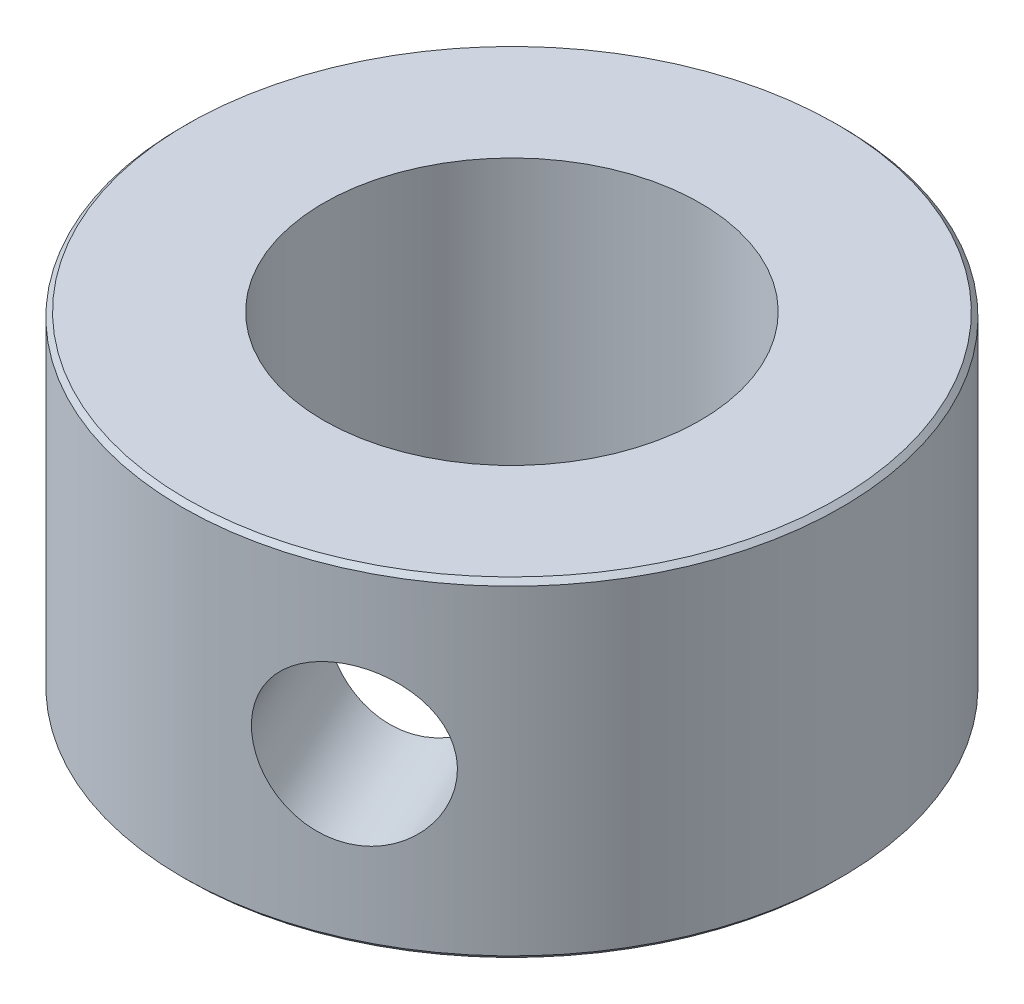
ISO-10303-21;
HEADER;
FILE_DESCRIPTION(('STEP AP214'),'2;1');
FILE_NAME('part.step','',(''),(''),'','','');
FILE_SCHEMA(('AUTOMOTIVE_DESIGN { 1 0 10303 214 1 1 1 1 }'));
ENDSEC;
DATA;
#1=APPLICATION_CONTEXT('core data for automotive mechanical design processes');
#2=APPLICATION_PROTOCOL_DEFINITION('international standard','automotive_design',2000,#1);
#3=PRODUCT_CONTEXT('',#1,'mechanical');
#4=PRODUCT('Part','Part','',(#3));
#5=PRODUCT_RELATED_PRODUCT_CATEGORY('part','',(#4));
#6=PRODUCT_DEFINITION_FORMATION('','',#4);
#7=PRODUCT_DEFINITION_CONTEXT('part definition',#1,'design');
#8=PRODUCT_DEFINITION('design','',#6,#7);
#9=PRODUCT_DEFINITION_SHAPE('','',#8);
#10=(LENGTH_UNIT() NAMED_UNIT(*) SI_UNIT(.MILLI.,.METRE.));
#11=(NAMED_UNIT(*) PLANE_ANGLE_UNIT() SI_UNIT($,.RADIAN.));
#12=(NAMED_UNIT(*) SI_UNIT($,.STERADIAN.) SOLID_ANGLE_UNIT());
#13=UNCERTAINTY_MEASURE_WITH_UNIT(LENGTH_MEASURE(1.E-05),#10,'distance_accuracy_value','');
#14=(GEOMETRIC_REPRESENTATION_CONTEXT(3) GLOBAL_UNCERTAINTY_ASSIGNED_CONTEXT((#13)) GLOBAL_UNIT_ASSIGNED_CONTEXT((#10,
#11,#12)) REPRESENTATION_CONTEXT('',''));
#15=CARTESIAN_POINT('',(0.,0.,0.));
#16=DIRECTION('',(0.,0.,1.));
#17=DIRECTION('',(1.,0.,0.));
#18=AXIS2_PLACEMENT_3D('',#15,#16,#17);
#19=CARTESIAN_POINT('',(0.,7.,0.));
#20=DIRECTION('',(0.,1.,0.));
#21=DIRECTION('',(0.,0.,1.));
#22=AXIS2_PLACEMENT_3D('',#19,#20,#21);
#23=PLANE('',#22);
#24=CARTESIAN_POINT('',(0.,7.,0.));
#25=DIRECTION('',(0.,1.,0.));
#26=DIRECTION('',(0.,0.,1.));
#27=AXIS2_PLACEMENT_3D('',#24,#25,#26);
#28=CIRCLE('',#27,6.9);
#29=CARTESIAN_POINT('',(0.,7.,6.9));
#30=VERTEX_POINT('',#29);
#31=EDGE_CURVE('E10',#30,#30,#28,.T.);
#32=ORIENTED_EDGE('',*,*,#31,.T.);
#33=EDGE_LOOP('',(#32));
#34=FACE_BOUND('',#33,.T.);
#35=CARTESIAN_POINT('',(0.,7.,0.));
#36=DIRECTION('',(0.,1.,0.));
#37=DIRECTION('',(0.,0.,1.));
#38=AXIS2_PLACEMENT_3D('',#35,#36,#37);
#39=CIRCLE('',#38,4.);
#40=CARTESIAN_POINT('',(0.,7.,4.));
#41=VERTEX_POINT('',#40);
#42=EDGE_CURVE('E66',#41,#41,#39,.T.);
#43=ORIENTED_EDGE('',*,*,#42,.F.);
#44=EDGE_LOOP('',(#43));
#45=FACE_BOUND('',#44,.T.);
#46=ADVANCED_FACE('F38',(#34,#45),#23,.T.);
#47=CARTESIAN_POINT('',(0.,0.,0.));
#48=DIRECTION('',(0.,1.,0.));
#49=DIRECTION('',(0.,0.,1.));
#50=AXIS2_PLACEMENT_3D('',#47,#48,#49);
#51=PLANE('',#50);
#52=CARTESIAN_POINT('',(0.,0.,0.));
#53=DIRECTION('',(0.,1.,0.));
#54=DIRECTION('',(0.,0.,1.));
#55=AXIS2_PLACEMENT_3D('',#52,#53,#54);
#56=CIRCLE('',#55,6.9);
#57=CARTESIAN_POINT('',(0.,0.,6.9));
#58=VERTEX_POINT('',#57);
#59=EDGE_CURVE('E45',#58,#58,#56,.F.);
#60=ORIENTED_EDGE('',*,*,#59,.T.);
#61=EDGE_LOOP('',(#60));
#62=FACE_BOUND('',#61,.T.);
#63=CARTESIAN_POINT('',(0.,0.,0.));
#64=DIRECTION('',(0.,1.,0.));
#65=DIRECTION('',(0.,0.,1.));
#66=AXIS2_PLACEMENT_3D('',#63,#64,#65);
#67=CIRCLE('',#66,4.);
#68=CARTESIAN_POINT('',(0.,0.,4.));
#69=VERTEX_POINT('',#68);
#70=EDGE_CURVE('E67',#69,#69,#67,.T.);
#71=ORIENTED_EDGE('',*,*,#70,.T.);
#72=EDGE_LOOP('',(#71));
#73=FACE_BOUND('',#72,.T.);
#74=ADVANCED_FACE('F94',(#62,#73),#51,.F.);
#75=CARTESIAN_POINT('',(0.,7.,0.));
#76=DIRECTION('',(0.,-1.,0.));
#77=DIRECTION('',(0.,0.,-1.));
#78=AXIS2_PLACEMENT_3D('',#75,#76,#77);
#79=CYLINDRICAL_SURFACE('',#78,7.);
#80=CARTESIAN_POINT('',(0.,0.1,0.));
#81=DIRECTION('',(0.,1.,0.));
#82=DIRECTION('',(0.,0.,1.));
#83=AXIS2_PLACEMENT_3D('',#80,#81,#82);
#84=CIRCLE('',#83,7.);
#85=CARTESIAN_POINT('',(0.,0.1,7.));
#86=VERTEX_POINT('',#85);
#87=EDGE_CURVE('E49',#86,#86,#84,.T.);
#88=ORIENTED_EDGE('',*,*,#87,.T.);
#89=EDGE_LOOP('',(#88));
#90=FACE_BOUND('',#89,.T.);
#91=CARTESIAN_POINT('',(0.,6.9,0.));
#92=DIRECTION('',(0.,1.,0.));
#93=DIRECTION('',(0.,0.,1.));
#94=AXIS2_PLACEMENT_3D('',#91,#92,#93);
#95=CIRCLE('',#94,7.);
#96=CARTESIAN_POINT('',(0.,6.9,7.));
#97=VERTEX_POINT('',#96);
#98=EDGE_CURVE('E53',#97,#97,#95,.F.);
#99=ORIENTED_EDGE('',*,*,#98,.T.);
#100=EDGE_LOOP('',(#99));
#101=FACE_BOUND('',#100,.T.);
#102=CARTESIAN_POINT('',(4.33695475854196,3.5,5.49461767754229));
#103=CARTESIAN_POINT('',(4.33695290809923,3.40871099997652,5.49462052617283));
#104=CARTESIAN_POINT('',(4.3308204478108,3.31738900161891,5.49947661884195));
#105=CARTESIAN_POINT('',(4.30642007110906,3.13735543656597,5.51860289653467));
#106=CARTESIAN_POINT('',(4.28814428934161,3.04864560071145,5.53287918307316));
#107=CARTESIAN_POINT('',(4.23988238827224,2.87646648747663,5.56994752920899));
#108=CARTESIAN_POINT('',(4.20991030824941,2.79299106604051,5.5927293780118));
#109=CARTESIAN_POINT('',(4.13886227276357,2.63338346720996,5.6455087575473));
#110=CARTESIAN_POINT('',(4.09778617216883,2.55725138581207,5.67550638259104));
#111=CARTESIAN_POINT('',(4.00448567264662,2.41300017131406,5.74172584098752));
#112=CARTESIAN_POINT('',(3.95207750988321,2.34504595472282,5.77804807616412));
#113=CARTESIAN_POINT('',(3.83756477380056,2.22052828829884,5.85472773588049));
#114=CARTESIAN_POINT('',(3.77545936948574,2.16396581562249,5.8950855061348));
#115=CARTESIAN_POINT('',(3.64198656861028,2.06317303018274,5.97847741494681));
#116=CARTESIAN_POINT('',(3.57051454492172,2.01910313876716,6.02153838899059));
#117=CARTESIAN_POINT('',(3.42057086009637,1.94558709172224,6.10795974013822));
#118=CARTESIAN_POINT('',(3.34210011561603,1.91613902430984,6.1513200773487));
#119=CARTESIAN_POINT('',(3.18166938286995,1.87322629782889,6.2357875098592));
#120=CARTESIAN_POINT('',(3.09979824945055,1.85948200603305,6.27692118266486));
#121=CARTESIAN_POINT('',(2.93356847400079,1.84749086323874,6.35630825329692));
#122=CARTESIAN_POINT('',(2.84921016192308,1.84924196573697,6.39456203080304));
#123=CARTESIAN_POINT('',(2.68219217534081,1.86798740501017,6.46637071990166));
#124=CARTESIAN_POINT('',(2.59953184601341,1.88468011500454,6.50000348980106));
#125=CARTESIAN_POINT('',(2.4366723032739,1.93235207443574,6.56279283289124));
#126=CARTESIAN_POINT('',(2.35647321238835,1.96333203390087,6.59194918352302));
#127=CARTESIAN_POINT('',(2.20026957556281,2.03895377039328,6.6457279442721));
#128=CARTESIAN_POINT('',(2.12430510224419,2.08370617046967,6.67031095667816));
#129=CARTESIAN_POINT('',(1.97956239020466,2.185519225885,6.71469078440217));
#130=CARTESIAN_POINT('',(1.91078527806698,2.24258180650105,6.73448685002701));
#131=CARTESIAN_POINT('',(1.7809711301695,2.36902452509401,6.76999157550689));
#132=CARTESIAN_POINT('',(1.72016071769164,2.43866849569449,6.78559016682727));
#133=CARTESIAN_POINT('',(1.61032671076822,2.5874443211498,6.81249254702226));
#134=CARTESIAN_POINT('',(1.56130354929443,2.66657652436841,6.82379617814235));
#135=CARTESIAN_POINT('',(1.47666330208507,2.83253525980706,6.84261364703833));
#136=CARTESIAN_POINT('',(1.44109924109201,2.91939059395085,6.85011253398433));
#137=CARTESIAN_POINT('',(1.38508822355287,3.09806127756916,6.86165848349057));
#138=CARTESIAN_POINT('',(1.36463843423409,3.18987569413077,6.86570619290513));
#139=CARTESIAN_POINT('',(1.34002741741275,3.37353855694924,6.87055176369806));
#140=CARTESIAN_POINT('',(1.33549350857823,3.46533515973006,6.87142399940529));
#141=CARTESIAN_POINT('',(1.34186731452449,3.64836457658374,6.87018213154625));
#142=CARTESIAN_POINT('',(1.35277378107572,3.73959743563189,6.86806826938189));
#143=CARTESIAN_POINT('',(1.38929825352498,3.91757745074746,6.86077149304204));
#144=CARTESIAN_POINT('',(1.41470564674566,4.00436984565374,6.85563248349688));
#145=CARTESIAN_POINT('',(1.47907488594476,4.17249368663451,6.8420328006842));
#146=CARTESIAN_POINT('',(1.51803819629995,4.25382454159378,6.83357176854278));
#147=CARTESIAN_POINT('',(1.6089117198084,4.41029905658938,6.81275318003319));
#148=CARTESIAN_POINT('',(1.66103829699158,4.48530818474253,6.80032948918988));
#149=CARTESIAN_POINT('',(1.7760975232139,4.62557800629822,6.7711883829357));
#150=CARTESIAN_POINT('',(1.8390317422003,4.69083728083161,6.75447034354099));
#151=CARTESIAN_POINT('',(1.97518588680678,4.81122298204254,6.71593224186882));
#152=CARTESIAN_POINT('',(2.04860137475439,4.86609535547159,6.69400817940542));
#153=CARTESIAN_POINT('',(2.20227224150703,4.9623180167779,6.64503502097462));
#154=CARTESIAN_POINT('',(2.2825272771498,5.00366898256504,6.61798618205064));
#155=CARTESIAN_POINT('',(2.4467542621969,5.0713378389333,6.55903535520843));
#156=CARTESIAN_POINT('',(2.53069634784018,5.0977586745676,6.52716857053034));
#157=CARTESIAN_POINT('',(2.70016326638837,5.13513286894145,6.45890503545275));
#158=CARTESIAN_POINT('',(2.7856878272703,5.14608886147333,6.42250905756199));
#159=CARTESIAN_POINT('',(2.95361249294322,5.15208813057132,6.34700294170077));
#160=CARTESIAN_POINT('',(3.03603823759707,5.14750832426095,6.30797929141249));
#161=CARTESIAN_POINT('',(3.19753347433021,5.12341975270526,6.22767321304482));
#162=CARTESIAN_POINT('',(3.27660304663566,5.10391134452658,6.18639083901215));
#163=CARTESIAN_POINT('',(3.42899022222941,5.05071176108927,6.10323970829406));
#164=CARTESIAN_POINT('',(3.50233107509893,5.01708187051131,6.06137423230331));
#165=CARTESIAN_POINT('',(3.64194798969843,4.9366509910792,5.97852928259634));
#166=CARTESIAN_POINT('',(3.7082232512061,4.88984851252764,5.93754990965491));
#167=CARTESIAN_POINT('',(3.83368684312346,4.78321390355334,5.85734707854002));
#168=CARTESIAN_POINT('',(3.89269059682572,4.72312153020512,5.81818087222184));
#169=CARTESIAN_POINT('',(4.000747446629,4.59212760248887,5.74441554290829));
#170=CARTESIAN_POINT('',(4.04979808207846,4.52122338274089,5.70981755002243));
#171=CARTESIAN_POINT('',(4.13770229302743,4.36924540614473,5.64645114230857));
#172=CARTESIAN_POINT('',(4.17637911535602,4.2880263885213,5.61778547287829));
#173=CARTESIAN_POINT('',(4.2416620994615,4.11860266624687,5.56866088592655));
#174=CARTESIAN_POINT('',(4.26827773329602,4.03040350750556,5.54819552989044));
#175=CARTESIAN_POINT('',(4.30463016708739,3.86853084559052,5.52001492462501));
#176=CARTESIAN_POINT('',(4.31673458241366,3.79568399515568,5.5105270007543));
#177=CARTESIAN_POINT('',(4.3328973646978,3.64856531846772,5.49782742587969));
#178=CARTESIAN_POINT('',(4.33695626448493,3.57429358690895,5.49461535924566));
#179=CARTESIAN_POINT('',(4.33695475854196,3.5,5.49461767754229));
#180=B_SPLINE_CURVE_WITH_KNOTS('',3,(#102,#103,#104,#105,#106,#107,#108,#109,#110,#111,#112,
#113,#114,#115,#116,#117,#118,#119,#120,#121,#122,#123,#124,#125,#126,#127,#128,#129,#130,#131,
#132,#133,#134,#135,#136,#137,#138,#139,#140,#141,#142,#143,#144,#145,#146,#147,#148,#149,#150,
#151,#152,#153,#154,#155,#156,#157,#158,#159,#160,#161,#162,#163,#164,#165,#166,#167,#168,#169,
#170,#171,#172,#173,#174,#175,#176,#177,#178,#179),.UNSPECIFIED.,.T.,.F.,(4,2,2,2,2,2,2,2,2,2,2,
2,2,2,2,2,2,2,2,2,2,2,2,2,2,2,2,2,2,2,2,2,2,2,2,2,2,2,4),(0.,0.273594440399257,
0.547366263700772,0.820810479503742,1.0942582694491,1.37252656286892,1.65081871531697,
1.93253747960749,2.21421939985747,2.49080324523181,2.76735056224875,3.03843805884696,
3.30953902903523,3.58287702808519,3.85625780745002,4.13623055025585,4.41621357550837,
4.69728844125183,4.97831061353601,5.25270687968442,5.52708096437944,5.79756789407087,
6.06808405216621,6.34337456664895,6.61870510445456,6.90008328124661,7.18144734868651,
7.46084693391314,7.74019892930649,8.0128224633276,8.28543947686363,8.55688541369865,
8.82836206089263,9.10571835709366,9.38314313916055,9.66503130549492,9.94669771026967,
10.1693714016501,10.3920303455577),.UNSPECIFIED.);
#181=CARTESIAN_POINT('',(4.33695475854196,3.5,5.49461767754229));
#182=VERTEX_POINT('',#181);
#183=EDGE_CURVE('E58',#182,#182,#180,.T.);
#184=ORIENTED_EDGE('',*,*,#183,.T.);
#185=EDGE_LOOP('',(#184));
#186=FACE_BOUND('',#185,.T.);
#187=ADVANCED_FACE('F69',(#90,#101,#186),#79,.T.);
#188=CARTESIAN_POINT('',(0.,7.,0.));
#189=DIRECTION('',(0.,-1.,0.));
#190=DIRECTION('',(0.,0.,-1.));
#191=AXIS2_PLACEMENT_3D('',#188,#189,#190);
#192=CYLINDRICAL_SURFACE('',#191,4.);
#193=CARTESIAN_POINT('',(3.01941624706044,3.5,2.62357114006605));
#194=CARTESIAN_POINT('',(3.01941144958077,3.41190351977432,2.62358329970489));
#195=CARTESIAN_POINT('',(3.01431509514671,3.32365956802641,2.62947842448701));
#196=CARTESIAN_POINT('',(2.99400573734745,3.14971293892112,2.65257427169993));
#197=CARTESIAN_POINT('',(2.97876501178491,3.0640178994024,2.66980597284604));
#198=CARTESIAN_POINT('',(2.93851283218737,2.89799706186937,2.71404237086341));
#199=CARTESIAN_POINT('',(2.91354065893688,2.8176511797814,2.74100774611007));
#200=CARTESIAN_POINT('',(2.8541662469186,2.66381823316578,2.80277769895583));
#201=CARTESIAN_POINT('',(2.81976636963666,2.59032945721597,2.83758031306585));
#202=CARTESIAN_POINT('',(2.73968469007096,2.4477713121535,2.91502885177799));
#203=CARTESIAN_POINT('',(2.69348439036254,2.3791707442198,2.95800197769271));
#204=CARTESIAN_POINT('',(2.59129959116768,2.25264522809124,3.04791662533316));
#205=CARTESIAN_POINT('',(2.53531137854823,2.19472434852778,3.09485964957403));
#206=CARTESIAN_POINT('',(2.41153898349142,2.08882862869814,3.19232424498335));
#207=CARTESIAN_POINT('',(2.34335557156882,2.04137906729385,3.24291316937387));
#208=CARTESIAN_POINT('',(2.19809677930497,1.9613298546783,3.3430727523345));
#209=CARTESIAN_POINT('',(2.12102529019716,1.92872373565344,3.39264384540126));
#210=CARTESIAN_POINT('',(1.96395594854863,1.88097929334378,3.4857972032843));
#211=CARTESIAN_POINT('',(1.88430915443039,1.86503315207677,3.52955607983508));
#212=CARTESIAN_POINT('',(1.72092940034066,1.84845334814483,3.61203022665663));
#213=CARTESIAN_POINT('',(1.63719807628572,1.84781360467799,3.65074749373731));
#214=CARTESIAN_POINT('',(1.47342329485833,1.8614364961366,3.71973844079712));
#215=CARTESIAN_POINT('',(1.3934579087069,1.8748121837171,3.75037809650607));
#216=CARTESIAN_POINT('',(1.23469092699598,1.91456881744776,3.80560189940168));
#217=CARTESIAN_POINT('',(1.15588941757692,1.94095072129068,3.83018560046747));
#218=CARTESIAN_POINT('',(1.00054395659582,2.00628766172018,3.87369632885558));
#219=CARTESIAN_POINT('',(0.924052635079114,2.04542798992487,3.89253154513523));
#220=CARTESIAN_POINT('',(0.776708004766597,2.13499127918661,3.92459153514696));
#221=CARTESIAN_POINT('',(0.705856686803698,2.18541820050331,3.93781433485606));
#222=CARTESIAN_POINT('',(0.567057563411857,2.30018823902864,3.96026845059458));
#223=CARTESIAN_POINT('',(0.499650934972131,2.36525341089873,3.96915979139928));
#224=CARTESIAN_POINT('',(0.375664111898481,2.50540966632158,3.98281000091138));
#225=CARTESIAN_POINT('',(0.319087930865847,2.5805044492633,3.98756733992239));
#226=CARTESIAN_POINT('',(0.217368093715309,2.74159840354732,3.99442601686795));
#227=CARTESIAN_POINT('',(0.172643187580061,2.82786757169265,3.99643848016928));
#228=CARTESIAN_POINT('',(0.0994067467926932,3.0070466714059,3.99893448422425));
#229=CARTESIAN_POINT('',(0.0708838887714532,3.09995191387382,3.99941909385245));
#230=CARTESIAN_POINT('',(0.0331008736343943,3.28342289518499,3.99990514662907));
#231=CARTESIAN_POINT('',(0.0227255162537152,3.37375830118286,3.99993550635091));
#232=CARTESIAN_POINT('',(0.0184282212574857,3.5548056296986,3.99995864089472));
#233=CARTESIAN_POINT('',(0.0245007771913549,3.64551741605928,3.99995142829444));
#234=CARTESIAN_POINT('',(0.0517991046420298,3.81880100904947,3.99968485991811));
#235=CARTESIAN_POINT('',(0.0720588860163648,3.90152817967461,3.99944121481733));
#236=CARTESIAN_POINT('',(0.125602117446577,4.06263706437997,3.99811654573303));
#237=CARTESIAN_POINT('',(0.158888571604349,4.14101777135166,3.9970353285393));
#238=CARTESIAN_POINT('',(0.238661955773673,4.29487900569563,3.99308079603675));
#239=CARTESIAN_POINT('',(0.285643783825149,4.37010019477924,3.99013425141886));
#240=CARTESIAN_POINT('',(0.3903577959711,4.51246016942973,3.98125344843018));
#241=CARTESIAN_POINT('',(0.448094565004334,4.57959548773512,3.97531791397801));
#242=CARTESIAN_POINT('',(0.577450979951415,4.70942962644671,3.95867729484451));
#243=CARTESIAN_POINT('',(0.64980930919276,4.77135173704872,3.9476306219003));
#244=CARTESIAN_POINT('',(0.802573341518197,4.88264285566206,3.91942630144447));
#245=CARTESIAN_POINT('',(0.882979564468714,4.93201105200319,3.90226825897586));
#246=CARTESIAN_POINT('',(1.04941434461576,5.01670413420678,3.86084025305739));
#247=CARTESIAN_POINT('',(1.13545280167505,5.05200347500272,3.8365574906217));
#248=CARTESIAN_POINT('',(1.31003334584918,5.10699165685874,3.78050214733575));
#249=CARTESIAN_POINT('',(1.398573944757,5.12668958293893,3.74873393941821));
#250=CARTESIAN_POINT('',(1.56888720219553,5.14878822892048,3.68054703677282));
#251=CARTESIAN_POINT('',(1.65070673787635,5.15228482874193,3.64459809409667));
#252=CARTESIAN_POINT('',(1.81119355726589,5.14481456562971,3.56756152339347));
#253=CARTESIAN_POINT('',(1.88986137203446,5.13385015000454,3.52647476592908));
#254=CARTESIAN_POINT('',(2.03922736006769,5.09855535786443,3.44218865379296));
#255=CARTESIAN_POINT('',(2.11010619856965,5.07469555788544,3.39910982863023));
#256=CARTESIAN_POINT('',(2.24538782394219,5.01479588512,3.3113053465099));
#257=CARTESIAN_POINT('',(2.30978936510477,4.97875367521331,3.26657937502556));
#258=CARTESIAN_POINT('',(2.43383660550365,4.89369547331361,3.17531665307993));
#259=CARTESIAN_POINT('',(2.49313798351049,4.84416874322707,3.12878896567008));
#260=CARTESIAN_POINT('',(2.60288153578027,4.73429715321,3.03810531475052));
#261=CARTESIAN_POINT('',(2.65332048971896,4.67394837691919,2.99395021739394));
#262=CARTESIAN_POINT('',(2.74794838114443,4.53941247264534,2.9074319849312));
#263=CARTESIAN_POINT('',(2.79149924372872,4.46457224311506,2.86538292246717));
#264=CARTESIAN_POINT('',(2.86762823897244,4.30573402431893,2.78919718326957));
#265=CARTESIAN_POINT('',(2.9002003081141,4.22173100829041,2.75506488214751));
#266=CARTESIAN_POINT('',(2.95374384708205,4.0472715587301,2.69758014399135));
#267=CARTESIAN_POINT('',(2.97478974493348,3.9568608919089,2.67415870975631));
#268=CARTESIAN_POINT('',(3.00514453401902,3.77195285592164,2.64000969722858));
#269=CARTESIAN_POINT('',(3.0144927977101,3.67747030912313,2.62923954418869));
#270=CARTESIAN_POINT('',(3.01892038614256,3.55513668635736,2.62413993321346));
#271=CARTESIAN_POINT('',(3.01941774874615,3.52757556771498,2.62356733391008));
#272=CARTESIAN_POINT('',(3.01941624706044,3.5,2.62357114006605));
#273=B_SPLINE_CURVE_WITH_KNOTS('',3,(#193,#194,#195,#196,#197,#198,#199,#200,#201,#202,#203,
#204,#205,#206,#207,#208,#209,#210,#211,#212,#213,#214,#215,#216,#217,#218,#219,#220,#221,#222,
#223,#224,#225,#226,#227,#228,#229,#230,#231,#232,#233,#234,#235,#236,#237,#238,#239,#240,#241,
#242,#243,#244,#245,#246,#247,#248,#249,#250,#251,#252,#253,#254,#255,#256,#257,#258,#259,#260,
#261,#262,#263,#264,#265,#266,#267,#268,#269,#270,#271,#272),.UNSPECIFIED.,.T.,.F.,(4,2,2,2,2,2,
2,2,2,2,2,2,2,2,2,2,2,2,2,2,2,2,2,2,2,2,2,2,2,2,2,2,2,2,2,2,2,2,2,4),(0.,0.264211724660743,
0.529148459018596,0.793026677872046,1.05683885985755,1.33523297260791,1.61373292676209,
1.90403076094908,2.19420198072698,2.46953816244269,2.74476495901023,3.00356896819765,
3.2623920368679,3.52515526924739,3.78801084539544,4.06907613148063,4.35024537535723,
4.64031806272422,4.93018777241109,5.20152035698262,5.47276211576041,5.72713321026164,
5.98156300028879,6.24665916965706,6.51186861189121,6.79815687284344,7.08446363898861,
7.37128791456168,7.65794504349148,7.92489841526077,8.19180661499932,8.44957452423756,
8.70739191275385,8.97680852354692,9.24632283025304,9.53374725602172,9.82133016535513,
10.1070334851925,10.3917725616093,10.4744749384331),.UNSPECIFIED.);
#274=CARTESIAN_POINT('',(3.01941624706044,3.5,2.62357114006605));
#275=VERTEX_POINT('',#274);
#276=EDGE_CURVE('E83',#275,#275,#273,.T.);
#277=ORIENTED_EDGE('',*,*,#276,.F.);
#278=EDGE_LOOP('',(#277));
#279=FACE_BOUND('',#278,.T.);
#280=ORIENTED_EDGE('',*,*,#42,.T.);
#281=EDGE_LOOP('',(#280));
#282=FACE_BOUND('',#281,.T.);
#283=ORIENTED_EDGE('',*,*,#70,.F.);
#284=EDGE_LOOP('',(#283));
#285=FACE_BOUND('',#284,.T.);
#286=ADVANCED_FACE('F77',(#279,#282,#285),#192,.F.);
#287=CARTESIAN_POINT('',(2.91958989736213,3.5,6.36207472694411));
#288=DIRECTION('',(0.417084271051733,0.,0.908867818134873));
#289=DIRECTION('',(0.908867818134873,0.,-0.417084271051734));
#290=AXIS2_PLACEMENT_3D('',#287,#288,#289);
#291=CYLINDRICAL_SURFACE('',#290,1.64999999999999);
#292=ORIENTED_EDGE('',*,*,#276,.T.);
#293=EDGE_LOOP('',(#292));
#294=FACE_BOUND('',#293,.T.);
#295=ORIENTED_EDGE('',*,*,#183,.F.);
#296=EDGE_LOOP('',(#295));
#297=FACE_BOUND('',#296,.T.);
#298=ADVANCED_FACE('F72',(#294,#297),#291,.F.);
#299=CARTESIAN_POINT('',(0.,0.1,0.));
#300=DIRECTION('',(0.,1.,0.));
#301=DIRECTION('',(0.,0.,1.));
#302=AXIS2_PLACEMENT_3D('',#299,#300,#301);
#303=CONICAL_SURFACE('',#302,7.,0.785398163397457);
#304=ORIENTED_EDGE('',*,*,#59,.F.);
#305=EDGE_LOOP('',(#304));
#306=FACE_BOUND('',#305,.T.);
#307=ORIENTED_EDGE('',*,*,#87,.F.);
#308=EDGE_LOOP('',(#307));
#309=FACE_BOUND('',#308,.T.);
#310=ADVANCED_FACE('F76',(#306,#309),#303,.T.);
#311=CARTESIAN_POINT('',(0.,7.,0.));
#312=DIRECTION('',(0.,-1.,0.));
#313=DIRECTION('',(0.,0.,-1.));
#314=AXIS2_PLACEMENT_3D('',#311,#312,#313);
#315=CONICAL_SURFACE('',#314,6.9,0.785398163397466);
#316=ORIENTED_EDGE('',*,*,#98,.F.);
#317=EDGE_LOOP('',(#316));
#318=FACE_BOUND('',#317,.T.);
#319=ORIENTED_EDGE('',*,*,#31,.F.);
#320=EDGE_LOOP('',(#319));
#321=FACE_BOUND('',#320,.T.);
#322=ADVANCED_FACE('F40',(#318,#321),#315,.T.);
#323=CLOSED_SHELL('',(#46,#74,#187,#286,#298,#310,#322));
#324=MANIFOLD_SOLID_BREP('B2',#323);
#325=ADVANCED_BREP_SHAPE_REPRESENTATION('',(#18,#324),#14);
#326=SHAPE_DEFINITION_REPRESENTATION(#9,#325);
ENDSEC;
END-ISO-10303-21;
